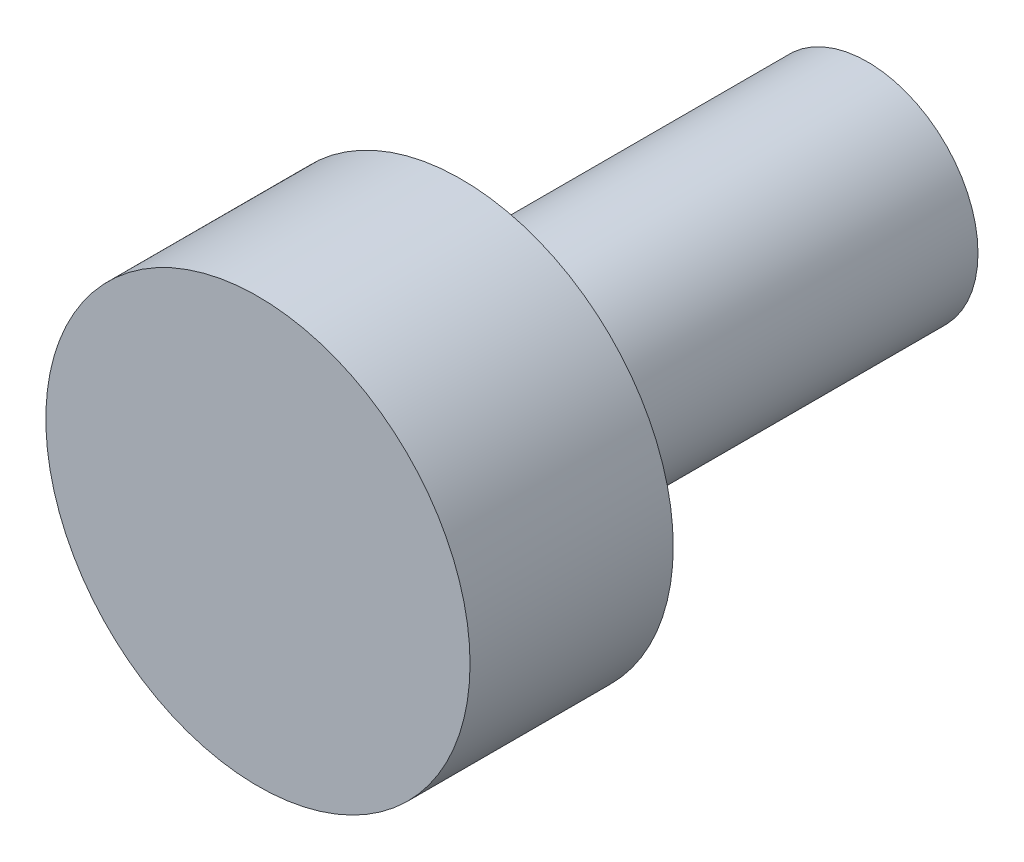
ISO-10303-21;
HEADER;
FILE_DESCRIPTION(('STEP AP214'),'2;1');
FILE_NAME('part.step','',(''),(''),'','','');
FILE_SCHEMA(('AUTOMOTIVE_DESIGN { 1 0 10303 214 1 1 1 1 }'));
ENDSEC;
DATA;
#1=APPLICATION_CONTEXT('core data for automotive mechanical design processes');
#2=APPLICATION_PROTOCOL_DEFINITION('international standard','automotive_design',2000,#1);
#3=PRODUCT_CONTEXT('',#1,'mechanical');
#4=PRODUCT('Part','Part','',(#3));
#5=PRODUCT_RELATED_PRODUCT_CATEGORY('part','',(#4));
#6=PRODUCT_DEFINITION_FORMATION('','',#4);
#7=PRODUCT_DEFINITION_CONTEXT('part definition',#1,'design');
#8=PRODUCT_DEFINITION('design','',#6,#7);
#9=PRODUCT_DEFINITION_SHAPE('','',#8);
#10=(LENGTH_UNIT() NAMED_UNIT(*) SI_UNIT(.MILLI.,.METRE.));
#11=(NAMED_UNIT(*) PLANE_ANGLE_UNIT() SI_UNIT($,.RADIAN.));
#12=(NAMED_UNIT(*) SI_UNIT($,.STERADIAN.) SOLID_ANGLE_UNIT());
#13=UNCERTAINTY_MEASURE_WITH_UNIT(LENGTH_MEASURE(1.E-05),#10,'distance_accuracy_value','');
#14=(GEOMETRIC_REPRESENTATION_CONTEXT(3) GLOBAL_UNCERTAINTY_ASSIGNED_CONTEXT((#13)) GLOBAL_UNIT_ASSIGNED_CONTEXT((#10,
#11,#12)) REPRESENTATION_CONTEXT('',''));
#15=CARTESIAN_POINT('',(0.,0.,0.));
#16=DIRECTION('',(0.,0.,1.));
#17=DIRECTION('',(1.,0.,0.));
#18=AXIS2_PLACEMENT_3D('',#15,#16,#17);
#19=CARTESIAN_POINT('',(0.,0.,6.35));
#20=DIRECTION('',(0.,0.,-1.));
#21=DIRECTION('',(-1.,0.,0.));
#22=AXIS2_PLACEMENT_3D('',#19,#20,#21);
#23=CYLINDRICAL_SURFACE('',#22,1.7272);
#24=CARTESIAN_POINT('',(0.,0.,6.35));
#25=DIRECTION('',(0.,0.,1.));
#26=DIRECTION('',(1.,0.,0.));
#27=AXIS2_PLACEMENT_3D('',#24,#25,#26);
#28=CIRCLE('',#27,1.7272);
#29=CARTESIAN_POINT('',(1.7272,0.,6.35));
#30=VERTEX_POINT('',#29);
#31=EDGE_CURVE('E10',#30,#30,#28,.T.);
#32=ORIENTED_EDGE('',*,*,#31,.F.);
#33=EDGE_LOOP('',(#32));
#34=FACE_BOUND('',#33,.T.);
#35=CARTESIAN_POINT('',(0.,0.,0.));
#36=DIRECTION('',(0.,0.,1.));
#37=DIRECTION('',(1.,0.,0.));
#38=AXIS2_PLACEMENT_3D('',#35,#36,#37);
#39=CIRCLE('',#38,1.7272);
#40=CARTESIAN_POINT('',(1.7272,0.,0.));
#41=VERTEX_POINT('',#40);
#42=EDGE_CURVE('E34',#41,#41,#39,.T.);
#43=ORIENTED_EDGE('',*,*,#42,.T.);
#44=EDGE_LOOP('',(#43));
#45=FACE_BOUND('',#44,.T.);
#46=ADVANCED_FACE('F31',(#34,#45),#23,.T.);
#47=CARTESIAN_POINT('',(0.,0.,0.));
#48=DIRECTION('',(0.,0.,1.));
#49=DIRECTION('',(1.,0.,0.));
#50=AXIS2_PLACEMENT_3D('',#47,#48,#49);
#51=PLANE('',#50);
#52=ORIENTED_EDGE('',*,*,#42,.F.);
#53=EDGE_LOOP('',(#52));
#54=FACE_BOUND('',#53,.T.);
#55=ADVANCED_FACE('F54',(#54),#51,.F.);
#56=CARTESIAN_POINT('',(0.,0.,9.525));
#57=DIRECTION('',(0.,0.,-1.));
#58=DIRECTION('',(-1.,0.,0.));
#59=AXIS2_PLACEMENT_3D('',#56,#57,#58);
#60=CYLINDRICAL_SURFACE('',#59,3.3147);
#61=CARTESIAN_POINT('',(0.,0.,9.525));
#62=DIRECTION('',(0.,0.,1.));
#63=DIRECTION('',(1.,0.,0.));
#64=AXIS2_PLACEMENT_3D('',#61,#62,#63);
#65=CIRCLE('',#64,3.3147);
#66=CARTESIAN_POINT('',(3.3147,0.,9.525));
#67=VERTEX_POINT('',#66);
#68=EDGE_CURVE('E41',#67,#67,#65,.T.);
#69=ORIENTED_EDGE('',*,*,#68,.F.);
#70=EDGE_LOOP('',(#69));
#71=FACE_BOUND('',#70,.T.);
#72=CARTESIAN_POINT('',(0.,0.,6.35));
#73=DIRECTION('',(0.,0.,1.));
#74=DIRECTION('',(1.,0.,0.));
#75=AXIS2_PLACEMENT_3D('',#72,#73,#74);
#76=CIRCLE('',#75,3.3147);
#77=CARTESIAN_POINT('',(3.3147,0.,6.35));
#78=VERTEX_POINT('',#77);
#79=EDGE_CURVE('E43',#78,#78,#76,.T.);
#80=ORIENTED_EDGE('',*,*,#79,.T.);
#81=EDGE_LOOP('',(#80));
#82=FACE_BOUND('',#81,.T.);
#83=ADVANCED_FACE('F51',(#71,#82),#60,.T.);
#84=CARTESIAN_POINT('',(0.,0.,9.525));
#85=DIRECTION('',(0.,0.,1.));
#86=DIRECTION('',(1.,0.,0.));
#87=AXIS2_PLACEMENT_3D('',#84,#85,#86);
#88=PLANE('',#87);
#89=ORIENTED_EDGE('',*,*,#68,.T.);
#90=EDGE_LOOP('',(#89));
#91=FACE_BOUND('',#90,.T.);
#92=ADVANCED_FACE('F49',(#91),#88,.T.);
#93=CARTESIAN_POINT('',(0.,0.,6.35));
#94=DIRECTION('',(0.,0.,1.));
#95=DIRECTION('',(1.,0.,0.));
#96=AXIS2_PLACEMENT_3D('',#93,#94,#95);
#97=PLANE('',#96);
#98=ORIENTED_EDGE('',*,*,#31,.T.);
#99=EDGE_LOOP('',(#98));
#100=FACE_BOUND('',#99,.T.);
#101=ORIENTED_EDGE('',*,*,#79,.F.);
#102=EDGE_LOOP('',(#101));
#103=FACE_BOUND('',#102,.T.);
#104=ADVANCED_FACE('F58',(#100,#103),#97,.F.);
#105=CLOSED_SHELL('',(#46,#55,#83,#92,#104));
#106=MANIFOLD_SOLID_BREP('B2',#105);
#107=ADVANCED_BREP_SHAPE_REPRESENTATION('',(#18,#106),#14);
#108=SHAPE_DEFINITION_REPRESENTATION(#9,#107);
ENDSEC;
END-ISO-10303-21;
